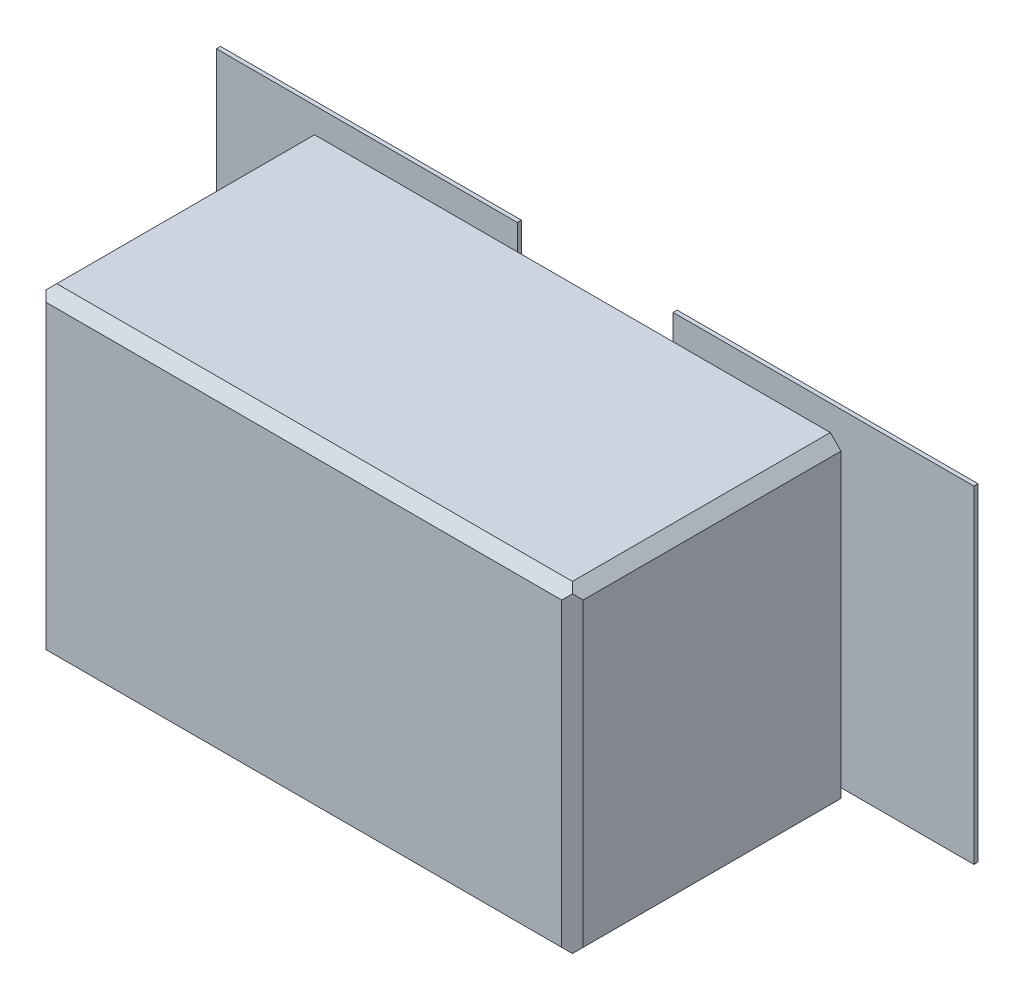
ISO-10303-21;
HEADER;
FILE_DESCRIPTION(('STEP AP214'),'2;1');
FILE_NAME('part.step','',(''),(''),'','','');
FILE_SCHEMA(('AUTOMOTIVE_DESIGN { 1 0 10303 214 1 1 1 1 }'));
ENDSEC;
DATA;
#1=APPLICATION_CONTEXT('core data for automotive mechanical design processes');
#2=APPLICATION_PROTOCOL_DEFINITION('international standard','automotive_design',2000,#1);
#3=PRODUCT_CONTEXT('',#1,'mechanical');
#4=PRODUCT('Part','Part','',(#3));
#5=PRODUCT_RELATED_PRODUCT_CATEGORY('part','',(#4));
#6=PRODUCT_DEFINITION_FORMATION('','',#4);
#7=PRODUCT_DEFINITION_CONTEXT('part definition',#1,'design');
#8=PRODUCT_DEFINITION('design','',#6,#7);
#9=PRODUCT_DEFINITION_SHAPE('','',#8);
#10=(LENGTH_UNIT() NAMED_UNIT(*) SI_UNIT(.MILLI.,.METRE.));
#11=(NAMED_UNIT(*) PLANE_ANGLE_UNIT() SI_UNIT($,.RADIAN.));
#12=(NAMED_UNIT(*) SI_UNIT($,.STERADIAN.) SOLID_ANGLE_UNIT());
#13=UNCERTAINTY_MEASURE_WITH_UNIT(LENGTH_MEASURE(1.E-05),#10,'distance_accuracy_value','');
#14=(GEOMETRIC_REPRESENTATION_CONTEXT(3) GLOBAL_UNCERTAINTY_ASSIGNED_CONTEXT((#13)) GLOBAL_UNIT_ASSIGNED_CONTEXT((#10,
#11,#12)) REPRESENTATION_CONTEXT('',''));
#15=CARTESIAN_POINT('',(0.,0.,0.));
#16=DIRECTION('',(0.,0.,1.));
#17=DIRECTION('',(1.,0.,0.));
#18=AXIS2_PLACEMENT_3D('',#15,#16,#17);
#19=CARTESIAN_POINT('',(0.,0.,0.0862));
#20=DIRECTION('',(0.,0.,-1.));
#21=DIRECTION('',(-1.,0.,0.));
#22=AXIS2_PLACEMENT_3D('',#19,#20,#21);
#23=PLANE('',#22);
#24=DIRECTION('',(1.,0.,0.));
#25=VECTOR('',#24,1.);
#26=CARTESIAN_POINT('',(-0.4159973957868,0.25,0.0862));
#27=LINE('',#26,#25);
#28=CARTESIAN_POINT('',(-0.2159973957868,0.25,0.0862));
#29=VERTEX_POINT('',#28);
#30=CARTESIAN_POINT('',(-0.4159973957868,0.25,0.0862));
#31=VERTEX_POINT('',#30);
#32=EDGE_CURVE('P0_E184',#29,#31,#27,.F.);
#33=ORIENTED_EDGE('',*,*,#32,.F.);
#34=DIRECTION('',(0.,1.,0.));
#35=VECTOR('',#34,1.);
#36=CARTESIAN_POINT('',(-0.2159973957868,0.25,0.0862));
#37=LINE('',#36,#35);
#38=CARTESIAN_POINT('',(-0.2159973957868,-0.25,0.0862));
#39=VERTEX_POINT('',#38);
#40=EDGE_CURVE('P0_E212',#39,#29,#37,.T.);
#41=ORIENTED_EDGE('',*,*,#40,.F.);
#42=DIRECTION('',(1.,0.,0.));
#43=VECTOR('',#42,1.);
#44=CARTESIAN_POINT('',(-0.2159973957868,-0.25,0.0862));
#45=LINE('',#44,#43);
#46=CARTESIAN_POINT('',(-0.4659973957868,-0.25,0.0862));
#47=VERTEX_POINT('',#46);
#48=EDGE_CURVE('P0_E163',#47,#39,#45,.T.);
#49=ORIENTED_EDGE('',*,*,#48,.F.);
#50=DIRECTION('',(0.,1.,0.));
#51=VECTOR('',#50,1.);
#52=CARTESIAN_POINT('',(-0.4659973957868,-0.25,0.0862));
#53=LINE('',#52,#51);
#54=CARTESIAN_POINT('',(-0.4659973957868,0.2,0.0862));
#55=VERTEX_POINT('',#54);
#56=EDGE_CURVE('P0_E157',#55,#47,#53,.F.);
#57=ORIENTED_EDGE('',*,*,#56,.F.);
#58=CARTESIAN_POINT('',(-0.4659973957868,0.25,0.0862));
#59=DIRECTION('',(0.,0.,-1.));
#60=DIRECTION('',(-1.,0.,0.));
#61=AXIS2_PLACEMENT_3D('',#58,#59,#60);
#62=CIRCLE('',#61,0.05);
#63=EDGE_CURVE('P0_E20',#55,#31,#62,.F.);
#64=ORIENTED_EDGE('',*,*,#63,.T.);
#65=EDGE_LOOP('',(#33,#41,#49,#57,#64));
#66=FACE_BOUND('',#65,.T.);
#67=ADVANCED_FACE('P0_F17',(#66),#23,.T.);
#68=CARTESIAN_POINT('',(0.,0.,0.0862));
#69=DIRECTION('',(0.,0.,-1.));
#70=DIRECTION('',(-1.,0.,0.));
#71=AXIS2_PLACEMENT_3D('',#68,#69,#70);
#72=PLANE('',#71);
#73=DIRECTION('',(1.,0.,0.));
#74=VECTOR('',#73,1.);
#75=CARTESIAN_POINT('',(0.1840026042132,0.25,0.0862));
#76=LINE('',#75,#74);
#77=CARTESIAN_POINT('',(0.4340026042132,0.25,0.0862));
#78=VERTEX_POINT('',#77);
#79=CARTESIAN_POINT('',(0.1840026042132,0.25,0.0862));
#80=VERTEX_POINT('',#79);
#81=EDGE_CURVE('P0_E232',#78,#80,#76,.F.);
#82=ORIENTED_EDGE('',*,*,#81,.F.);
#83=DIRECTION('',(0.,1.,0.));
#84=VECTOR('',#83,1.);
#85=CARTESIAN_POINT('',(0.4340026042132,0.25,0.0862));
#86=LINE('',#85,#84);
#87=CARTESIAN_POINT('',(0.4340026042132,-0.25,0.0862));
#88=VERTEX_POINT('',#87);
#89=EDGE_CURVE('P0_E249',#88,#78,#86,.T.);
#90=ORIENTED_EDGE('',*,*,#89,.F.);
#91=DIRECTION('',(1.,0.,0.));
#92=VECTOR('',#91,1.);
#93=CARTESIAN_POINT('',(0.4340026042132,-0.25,0.0862));
#94=LINE('',#93,#92);
#95=CARTESIAN_POINT('',(0.1840026042132,-0.25,0.0862));
#96=VERTEX_POINT('',#95);
#97=EDGE_CURVE('P0_E247',#96,#88,#94,.T.);
#98=ORIENTED_EDGE('',*,*,#97,.F.);
#99=DIRECTION('',(0.,1.,0.));
#100=VECTOR('',#99,1.);
#101=CARTESIAN_POINT('',(0.1840026042132,-0.25,0.0862));
#102=LINE('',#101,#100);
#103=EDGE_CURVE('P0_E241',#80,#96,#102,.F.);
#104=ORIENTED_EDGE('',*,*,#103,.F.);
#105=EDGE_LOOP('',(#82,#90,#98,#104));
#106=FACE_BOUND('',#105,.T.);
#107=ADVANCED_FACE('P0_F273',(#106),#72,.T.);
#108=CARTESIAN_POINT('',(-0.2159973957868,0.25,0.1262));
#109=DIRECTION('',(1.,0.,0.));
#110=DIRECTION('',(0.,0.,-1.));
#111=AXIS2_PLACEMENT_3D('',#108,#109,#110);
#112=PLANE('',#111);
#113=DIRECTION('',(0.,0.,1.));
#114=VECTOR('',#113,1.);
#115=CARTESIAN_POINT('',(-0.2159973957868,0.25,0.1262));
#116=LINE('',#115,#114);
#117=CARTESIAN_POINT('',(-0.2159973957868,0.25,0.1262));
#118=VERTEX_POINT('',#117);
#119=EDGE_CURVE('P0_E182',#118,#29,#116,.F.);
#120=ORIENTED_EDGE('',*,*,#119,.F.);
#121=DIRECTION('',(0.,1.,0.));
#122=VECTOR('',#121,1.);
#123=CARTESIAN_POINT('',(-0.2159973957868,0.,0.1262));
#124=LINE('',#123,#122);
#125=CARTESIAN_POINT('',(-0.2159973957868,-0.25,0.1262));
#126=VERTEX_POINT('',#125);
#127=EDGE_CURVE('P0_E194',#118,#126,#124,.F.);
#128=ORIENTED_EDGE('',*,*,#127,.T.);
#129=DIRECTION('',(0.,0.,-1.));
#130=VECTOR('',#129,1.);
#131=CARTESIAN_POINT('',(-0.2159973957868,-0.25,0.1262));
#132=LINE('',#131,#130);
#133=EDGE_CURVE('P0_E168',#39,#126,#132,.F.);
#134=ORIENTED_EDGE('',*,*,#133,.F.);
#135=ORIENTED_EDGE('',*,*,#40,.T.);
#136=EDGE_LOOP('',(#120,#128,#134,#135));
#137=FACE_BOUND('',#136,.T.);
#138=ADVANCED_FACE('P0_F262',(#137),#112,.T.);
#139=CARTESIAN_POINT('',(-0.2159973957868,-0.25,0.1262));
#140=DIRECTION('',(0.,-1.,0.));
#141=DIRECTION('',(0.,0.,-1.));
#142=AXIS2_PLACEMENT_3D('',#139,#140,#141);
#143=PLANE('',#142);
#144=ORIENTED_EDGE('',*,*,#133,.T.);
#145=DIRECTION('',(1.,0.,0.));
#146=VECTOR('',#145,1.);
#147=CARTESIAN_POINT('',(0.,-0.25,0.1262));
#148=LINE('',#147,#146);
#149=CARTESIAN_POINT('',(-0.4659973957868,-0.25,0.1262));
#150=VERTEX_POINT('',#149);
#151=EDGE_CURVE('P0_E196',#126,#150,#148,.F.);
#152=ORIENTED_EDGE('',*,*,#151,.T.);
#153=DIRECTION('',(0.,0.,1.));
#154=VECTOR('',#153,1.);
#155=CARTESIAN_POINT('',(-0.4659973957868,-0.25,0.1262));
#156=LINE('',#155,#154);
#157=EDGE_CURVE('P0_E167',#47,#150,#156,.T.);
#158=ORIENTED_EDGE('',*,*,#157,.F.);
#159=ORIENTED_EDGE('',*,*,#48,.T.);
#160=EDGE_LOOP('',(#144,#152,#158,#159));
#161=FACE_BOUND('',#160,.T.);
#162=ADVANCED_FACE('P0_F264',(#161),#143,.T.);
#163=CARTESIAN_POINT('',(-0.4659973957868,-0.25,0.1262));
#164=DIRECTION('',(-1.,0.,0.));
#165=DIRECTION('',(0.,0.,1.));
#166=AXIS2_PLACEMENT_3D('',#163,#164,#165);
#167=PLANE('',#166);
#168=ORIENTED_EDGE('',*,*,#157,.T.);
#169=DIRECTION('',(0.,1.,0.));
#170=VECTOR('',#169,1.);
#171=CARTESIAN_POINT('',(-0.4659973957868,0.,0.1262));
#172=LINE('',#171,#170);
#173=CARTESIAN_POINT('',(-0.4659973957868,0.2,0.1262));
#174=VERTEX_POINT('',#173);
#175=EDGE_CURVE('P0_E174',#150,#174,#172,.T.);
#176=ORIENTED_EDGE('',*,*,#175,.T.);
#177=DIRECTION('',(0.,0.,-1.));
#178=VECTOR('',#177,1.);
#179=CARTESIAN_POINT('',(-0.4659973957868,0.2,0.1262));
#180=LINE('',#179,#178);
#181=EDGE_CURVE('P0_E171',#174,#55,#180,.T.);
#182=ORIENTED_EDGE('',*,*,#181,.T.);
#183=ORIENTED_EDGE('',*,*,#56,.T.);
#184=EDGE_LOOP('',(#168,#176,#182,#183));
#185=FACE_BOUND('',#184,.T.);
#186=ADVANCED_FACE('P0_F172',(#185),#167,.T.);
#187=CARTESIAN_POINT('',(-0.4659973957868,0.25,0.1262));
#188=DIRECTION('',(0.,0.,-1.));
#189=DIRECTION('',(-1.,0.,0.));
#190=AXIS2_PLACEMENT_3D('',#187,#188,#189);
#191=CYLINDRICAL_SURFACE('',#190,0.05);
#192=ORIENTED_EDGE('',*,*,#63,.F.);
#193=ORIENTED_EDGE('',*,*,#181,.F.);
#194=CARTESIAN_POINT('',(-0.4659973957868,0.25,0.1262));
#195=DIRECTION('',(0.,0.,-1.));
#196=DIRECTION('',(-1.,0.,0.));
#197=AXIS2_PLACEMENT_3D('',#194,#195,#196);
#198=CIRCLE('',#197,0.05);
#199=CARTESIAN_POINT('',(-0.4159973957868,0.25,0.1262));
#200=VERTEX_POINT('',#199);
#201=EDGE_CURVE('P0_E220',#174,#200,#198,.F.);
#202=ORIENTED_EDGE('',*,*,#201,.T.);
#203=DIRECTION('',(0.,0.,1.));
#204=VECTOR('',#203,1.);
#205=CARTESIAN_POINT('',(-0.4159973957868,0.25,0.1262));
#206=LINE('',#205,#204);
#207=EDGE_CURVE('P0_E180',#31,#200,#206,.T.);
#208=ORIENTED_EDGE('',*,*,#207,.F.);
#209=EDGE_LOOP('',(#192,#193,#202,#208));
#210=FACE_BOUND('',#209,.T.);
#211=ADVANCED_FACE('P0_F178',(#210),#191,.F.);
#212=CARTESIAN_POINT('',(-0.4159973957868,0.25,0.1262));
#213=DIRECTION('',(0.,1.,0.));
#214=DIRECTION('',(0.,0.,1.));
#215=AXIS2_PLACEMENT_3D('',#212,#213,#214);
#216=PLANE('',#215);
#217=ORIENTED_EDGE('',*,*,#207,.T.);
#218=DIRECTION('',(1.,0.,0.));
#219=VECTOR('',#218,1.);
#220=CARTESIAN_POINT('',(0.,0.25,0.1262));
#221=LINE('',#220,#219);
#222=EDGE_CURVE('P0_E221',#200,#118,#221,.T.);
#223=ORIENTED_EDGE('',*,*,#222,.T.);
#224=ORIENTED_EDGE('',*,*,#119,.T.);
#225=ORIENTED_EDGE('',*,*,#32,.T.);
#226=EDGE_LOOP('',(#217,#223,#224,#225));
#227=FACE_BOUND('',#226,.T.);
#228=ADVANCED_FACE('P0_F254',(#227),#216,.T.);
#229=CARTESIAN_POINT('',(0.4340026042132,0.25,0.1262));
#230=DIRECTION('',(1.,0.,0.));
#231=DIRECTION('',(0.,0.,-1.));
#232=AXIS2_PLACEMENT_3D('',#229,#230,#231);
#233=PLANE('',#232);
#234=DIRECTION('',(0.,0.,1.));
#235=VECTOR('',#234,1.);
#236=CARTESIAN_POINT('',(0.4340026042132,0.25,0.1262));
#237=LINE('',#236,#235);
#238=CARTESIAN_POINT('',(0.4340026042132,0.25,0.1262));
#239=VERTEX_POINT('',#238);
#240=EDGE_CURVE('P0_E235',#239,#78,#237,.F.);
#241=ORIENTED_EDGE('',*,*,#240,.F.);
#242=DIRECTION('',(0.,1.,0.));
#243=VECTOR('',#242,1.);
#244=CARTESIAN_POINT('',(0.4340026042132,0.,0.1262));
#245=LINE('',#244,#243);
#246=CARTESIAN_POINT('',(0.4340026042132,-0.25,0.1262));
#247=VERTEX_POINT('',#246);
#248=EDGE_CURVE('P0_E222',#239,#247,#245,.F.);
#249=ORIENTED_EDGE('',*,*,#248,.T.);
#250=DIRECTION('',(0.,0.,-1.));
#251=VECTOR('',#250,1.);
#252=CARTESIAN_POINT('',(0.4340026042132,-0.25,0.1262));
#253=LINE('',#252,#251);
#254=EDGE_CURVE('P0_E244',#88,#247,#253,.F.);
#255=ORIENTED_EDGE('',*,*,#254,.F.);
#256=ORIENTED_EDGE('',*,*,#89,.T.);
#257=EDGE_LOOP('',(#241,#249,#255,#256));
#258=FACE_BOUND('',#257,.T.);
#259=ADVANCED_FACE('P0_F344',(#258),#233,.T.);
#260=CARTESIAN_POINT('',(0.4340026042132,-0.25,0.1262));
#261=DIRECTION('',(0.,-1.,0.));
#262=DIRECTION('',(0.,0.,-1.));
#263=AXIS2_PLACEMENT_3D('',#260,#261,#262);
#264=PLANE('',#263);
#265=ORIENTED_EDGE('',*,*,#254,.T.);
#266=DIRECTION('',(1.,0.,0.));
#267=VECTOR('',#266,1.);
#268=CARTESIAN_POINT('',(0.,-0.25,0.1262));
#269=LINE('',#268,#267);
#270=CARTESIAN_POINT('',(0.1840026042132,-0.25,0.1262));
#271=VERTEX_POINT('',#270);
#272=EDGE_CURVE('P0_E513',#247,#271,#269,.F.);
#273=ORIENTED_EDGE('',*,*,#272,.T.);
#274=DIRECTION('',(0.,0.,1.));
#275=VECTOR('',#274,1.);
#276=CARTESIAN_POINT('',(0.1840026042132,-0.25,0.1262));
#277=LINE('',#276,#275);
#278=EDGE_CURVE('P0_E238',#96,#271,#277,.T.);
#279=ORIENTED_EDGE('',*,*,#278,.F.);
#280=ORIENTED_EDGE('',*,*,#97,.T.);
#281=EDGE_LOOP('',(#265,#273,#279,#280));
#282=FACE_BOUND('',#281,.T.);
#283=ADVANCED_FACE('P0_F340',(#282),#264,.T.);
#284=CARTESIAN_POINT('',(0.1840026042132,-0.25,0.1262));
#285=DIRECTION('',(-1.,0.,0.));
#286=DIRECTION('',(0.,0.,1.));
#287=AXIS2_PLACEMENT_3D('',#284,#285,#286);
#288=PLANE('',#287);
#289=ORIENTED_EDGE('',*,*,#278,.T.);
#290=DIRECTION('',(0.,1.,0.));
#291=VECTOR('',#290,1.);
#292=CARTESIAN_POINT('',(0.1840026042132,0.,0.1262));
#293=LINE('',#292,#291);
#294=CARTESIAN_POINT('',(0.1840026042132,0.25,0.1262));
#295=VERTEX_POINT('',#294);
#296=EDGE_CURVE('P0_E517',#271,#295,#293,.T.);
#297=ORIENTED_EDGE('',*,*,#296,.T.);
#298=DIRECTION('',(0.,0.,1.));
#299=VECTOR('',#298,1.);
#300=CARTESIAN_POINT('',(0.1840026042132,0.25,0.1262));
#301=LINE('',#300,#299);
#302=EDGE_CURVE('P0_E197',#80,#295,#301,.T.);
#303=ORIENTED_EDGE('',*,*,#302,.F.);
#304=ORIENTED_EDGE('',*,*,#103,.T.);
#305=EDGE_LOOP('',(#289,#297,#303,#304));
#306=FACE_BOUND('',#305,.T.);
#307=ADVANCED_FACE('P0_F336',(#306),#288,.T.);
#308=CARTESIAN_POINT('',(0.1840026042132,0.25,0.1262));
#309=DIRECTION('',(0.,1.,0.));
#310=DIRECTION('',(0.,0.,1.));
#311=AXIS2_PLACEMENT_3D('',#308,#309,#310);
#312=PLANE('',#311);
#313=ORIENTED_EDGE('',*,*,#302,.T.);
#314=DIRECTION('',(1.,0.,0.));
#315=VECTOR('',#314,1.);
#316=CARTESIAN_POINT('',(0.,0.25,0.1262));
#317=LINE('',#316,#315);
#318=EDGE_CURVE('P0_E510',#295,#239,#317,.T.);
#319=ORIENTED_EDGE('',*,*,#318,.T.);
#320=ORIENTED_EDGE('',*,*,#240,.T.);
#321=ORIENTED_EDGE('',*,*,#81,.T.);
#322=EDGE_LOOP('',(#313,#319,#320,#321));
#323=FACE_BOUND('',#322,.T.);
#324=ADVANCED_FACE('P0_F332',(#323),#312,.T.);
#325=CARTESIAN_POINT('',(0.,0.,0.1262));
#326=DIRECTION('',(0.,0.,1.));
#327=DIRECTION('',(1.,0.,0.));
#328=AXIS2_PLACEMENT_3D('',#325,#326,#327);
#329=PLANE('',#328);
#330=ORIENTED_EDGE('',*,*,#296,.F.);
#331=ORIENTED_EDGE('',*,*,#272,.F.);
#332=ORIENTED_EDGE('',*,*,#248,.F.);
#333=ORIENTED_EDGE('',*,*,#318,.F.);
#334=EDGE_LOOP('',(#330,#331,#332,#333));
#335=FACE_BOUND('',#334,.T.);
#336=ORIENTED_EDGE('',*,*,#201,.F.);
#337=ORIENTED_EDGE('',*,*,#175,.F.);
#338=ORIENTED_EDGE('',*,*,#151,.F.);
#339=ORIENTED_EDGE('',*,*,#127,.F.);
#340=ORIENTED_EDGE('',*,*,#222,.F.);
#341=EDGE_LOOP('',(#336,#337,#338,#339,#340));
#342=FACE_BOUND('',#341,.T.);
#343=DIRECTION('',(0.707106781186548,0.707106781186548,0.));
#344=VECTOR('',#343,1.);
#345=CARTESIAN_POINT('',(0.49,-0.29,0.1262));
#346=LINE('',#345,#344);
#347=CARTESIAN_POINT('',(0.48,-0.3,0.1262));
#348=VERTEX_POINT('',#347);
#349=CARTESIAN_POINT('',(0.5,-0.28,0.1262));
#350=VERTEX_POINT('',#349);
#351=EDGE_CURVE('P0_E552',#348,#350,#346,.T.);
#352=ORIENTED_EDGE('',*,*,#351,.F.);
#353=DIRECTION('',(1.,0.,0.));
#354=VECTOR('',#353,1.);
#355=CARTESIAN_POINT('',(-0.5,-0.3,0.1262));
#356=LINE('',#355,#354);
#357=CARTESIAN_POINT('',(-0.48,-0.3,0.1262));
#358=VERTEX_POINT('',#357);
#359=EDGE_CURVE('P0_E542',#358,#348,#356,.T.);
#360=ORIENTED_EDGE('',*,*,#359,.F.);
#361=DIRECTION('',(0.707106781186548,-0.707106781186548,0.));
#362=VECTOR('',#361,1.);
#363=CARTESIAN_POINT('',(-0.49,-0.29,0.1262));
#364=LINE('',#363,#362);
#365=CARTESIAN_POINT('',(-0.5,-0.28,0.1262));
#366=VERTEX_POINT('',#365);
#367=EDGE_CURVE('P0_E537',#366,#358,#364,.T.);
#368=ORIENTED_EDGE('',*,*,#367,.F.);
#369=DIRECTION('',(0.,1.,0.));
#370=VECTOR('',#369,1.);
#371=CARTESIAN_POINT('',(-0.5,0.3,0.1262));
#372=LINE('',#371,#370);
#373=CARTESIAN_POINT('',(-0.5,0.28,0.1262));
#374=VERTEX_POINT('',#373);
#375=EDGE_CURVE('P0_E532',#374,#366,#372,.F.);
#376=ORIENTED_EDGE('',*,*,#375,.F.);
#377=DIRECTION('',(-0.707106781186548,-0.707106781186548,0.));
#378=VECTOR('',#377,1.);
#379=CARTESIAN_POINT('',(-0.49,0.29,0.1262));
#380=LINE('',#379,#378);
#381=CARTESIAN_POINT('',(-0.48,0.3,0.1262));
#382=VERTEX_POINT('',#381);
#383=EDGE_CURVE('P0_E527',#382,#374,#380,.T.);
#384=ORIENTED_EDGE('',*,*,#383,.F.);
#385=DIRECTION('',(1.,0.,0.));
#386=VECTOR('',#385,1.);
#387=CARTESIAN_POINT('',(0.5,0.3,0.1262));
#388=LINE('',#387,#386);
#389=CARTESIAN_POINT('',(0.48,0.3,0.1262));
#390=VERTEX_POINT('',#389);
#391=EDGE_CURVE('P0_E522',#390,#382,#388,.F.);
#392=ORIENTED_EDGE('',*,*,#391,.F.);
#393=DIRECTION('',(-0.707106781186548,0.707106781186548,0.));
#394=VECTOR('',#393,1.);
#395=CARTESIAN_POINT('',(0.49,0.29,0.1262));
#396=LINE('',#395,#394);
#397=CARTESIAN_POINT('',(0.5,0.28,0.1262));
#398=VERTEX_POINT('',#397);
#399=EDGE_CURVE('P0_E546',#398,#390,#396,.T.);
#400=ORIENTED_EDGE('',*,*,#399,.F.);
#401=DIRECTION('',(0.,1.,0.));
#402=VECTOR('',#401,1.);
#403=CARTESIAN_POINT('',(0.5,-0.3,0.1262));
#404=LINE('',#403,#402);
#405=EDGE_CURVE('P0_E557',#350,#398,#404,.T.);
#406=ORIENTED_EDGE('',*,*,#405,.F.);
#407=EDGE_LOOP('',(#352,#360,#368,#376,#384,#392,#400,#406));
#408=FACE_BOUND('',#407,.T.);
#409=ADVANCED_FACE('P0_F257',(#335,#342,#408),#329,.F.);
#410=CARTESIAN_POINT('',(0.5,0.3,0.0762));
#411=DIRECTION('',(0.,1.,0.));
#412=DIRECTION('',(0.,0.,1.));
#413=AXIS2_PLACEMENT_3D('',#410,#411,#412);
#414=PLANE('',#413);
#415=DIRECTION('',(1.,0.,0.));
#416=VECTOR('',#415,1.);
#417=CARTESIAN_POINT('',(0.,0.3,0.6062));
#418=LINE('',#417,#416);
#419=CARTESIAN_POINT('',(0.48,0.3,0.6062));
#420=VERTEX_POINT('',#419);
#421=CARTESIAN_POINT('',(-0.48,0.3,0.6062));
#422=VERTEX_POINT('',#421);
#423=EDGE_CURVE('P0_E566',#420,#422,#418,.F.);
#424=ORIENTED_EDGE('',*,*,#423,.F.);
#425=DIRECTION('',(0.,0.,1.));
#426=VECTOR('',#425,1.);
#427=CARTESIAN_POINT('',(0.48,0.3,0.3762));
#428=LINE('',#427,#426);
#429=EDGE_CURVE('P0_E544',#390,#420,#428,.T.);
#430=ORIENTED_EDGE('',*,*,#429,.F.);
#431=ORIENTED_EDGE('',*,*,#391,.T.);
#432=DIRECTION('',(0.,0.,1.));
#433=VECTOR('',#432,1.);
#434=CARTESIAN_POINT('',(-0.48,0.3,0.3762));
#435=LINE('',#434,#433);
#436=EDGE_CURVE('P0_E524',#422,#382,#435,.F.);
#437=ORIENTED_EDGE('',*,*,#436,.F.);
#438=EDGE_LOOP('',(#424,#430,#431,#437));
#439=FACE_BOUND('',#438,.T.);
#440=ADVANCED_FACE('P0_F325',(#439),#414,.T.);
#441=CARTESIAN_POINT('',(-0.49,0.29,0.3762));
#442=DIRECTION('',(-0.707106781186548,0.707106781186548,0.));
#443=DIRECTION('',(-0.707106781186548,-0.707106781186548,0.));
#444=AXIS2_PLACEMENT_3D('',#441,#442,#443);
#445=PLANE('',#444);
#446=ORIENTED_EDGE('',*,*,#436,.T.);
#447=ORIENTED_EDGE('',*,*,#383,.T.);
#448=DIRECTION('',(0.,0.,1.));
#449=VECTOR('',#448,1.);
#450=CARTESIAN_POINT('',(-0.5,0.28,0.0762));
#451=LINE('',#450,#449);
#452=CARTESIAN_POINT('',(-0.5,0.28,0.6062));
#453=VERTEX_POINT('',#452);
#454=EDGE_CURVE('P0_E529',#453,#374,#451,.F.);
#455=ORIENTED_EDGE('',*,*,#454,.F.);
#456=DIRECTION('',(-0.577350269189627,-0.577350269189624,-0.577350269189627));
#457=VECTOR('',#456,1.);
#458=CARTESIAN_POINT('',(-0.49,0.29,0.6162));
#459=LINE('',#458,#457);
#460=CARTESIAN_POINT('',(-0.49,0.29,0.6162));
#461=VERTEX_POINT('',#460);
#462=EDGE_CURVE('P0_E576',#461,#453,#459,.T.);
#463=ORIENTED_EDGE('',*,*,#462,.F.);
#464=DIRECTION('',(-0.577350269189624,-0.577350269189627,0.577350269189627));
#465=VECTOR('',#464,1.);
#466=CARTESIAN_POINT('',(-0.48,0.3,0.6062));
#467=LINE('',#466,#465);
#468=EDGE_CURVE('P0_E569',#422,#461,#467,.T.);
#469=ORIENTED_EDGE('',*,*,#468,.F.);
#470=EDGE_LOOP('',(#446,#447,#455,#463,#469));
#471=FACE_BOUND('',#470,.T.);
#472=ADVANCED_FACE('P0_F321',(#471),#445,.T.);
#473=CARTESIAN_POINT('',(-0.5,0.3,0.0762));
#474=DIRECTION('',(-1.,0.,0.));
#475=DIRECTION('',(0.,0.,1.));
#476=AXIS2_PLACEMENT_3D('',#473,#474,#475);
#477=PLANE('',#476);
#478=ORIENTED_EDGE('',*,*,#375,.T.);
#479=DIRECTION('',(0.,0.,1.));
#480=VECTOR('',#479,1.);
#481=CARTESIAN_POINT('',(-0.5,-0.28,0.3762));
#482=LINE('',#481,#480);
#483=CARTESIAN_POINT('',(-0.5,-0.28,0.6062));
#484=VERTEX_POINT('',#483);
#485=EDGE_CURVE('P0_E534',#484,#366,#482,.F.);
#486=ORIENTED_EDGE('',*,*,#485,.F.);
#487=DIRECTION('',(0.,1.,0.));
#488=VECTOR('',#487,1.);
#489=CARTESIAN_POINT('',(-0.5,0.,0.6062));
#490=LINE('',#489,#488);
#491=EDGE_CURVE('P0_E579',#453,#484,#490,.F.);
#492=ORIENTED_EDGE('',*,*,#491,.F.);
#493=ORIENTED_EDGE('',*,*,#454,.T.);
#494=EDGE_LOOP('',(#478,#486,#492,#493));
#495=FACE_BOUND('',#494,.T.);
#496=ADVANCED_FACE('P0_F317',(#495),#477,.T.);
#497=CARTESIAN_POINT('',(-0.49,-0.29,0.3762));
#498=DIRECTION('',(-0.707106781186548,-0.707106781186548,0.));
#499=DIRECTION('',(0.707106781186548,-0.707106781186548,0.));
#500=AXIS2_PLACEMENT_3D('',#497,#498,#499);
#501=PLANE('',#500);
#502=ORIENTED_EDGE('',*,*,#485,.T.);
#503=ORIENTED_EDGE('',*,*,#367,.T.);
#504=DIRECTION('',(0.,0.,-1.));
#505=VECTOR('',#504,1.);
#506=CARTESIAN_POINT('',(-0.48,-0.3,0.0762));
#507=LINE('',#506,#505);
#508=CARTESIAN_POINT('',(-0.48,-0.3,0.6062));
#509=VERTEX_POINT('',#508);
#510=EDGE_CURVE('P0_E539',#509,#358,#507,.T.);
#511=ORIENTED_EDGE('',*,*,#510,.F.);
#512=DIRECTION('',(0.577350269189624,-0.577350269189627,-0.577350269189627));
#513=VECTOR('',#512,1.);
#514=CARTESIAN_POINT('',(-0.49,-0.29,0.6162));
#515=LINE('',#514,#513);
#516=CARTESIAN_POINT('',(-0.49,-0.29,0.6162));
#517=VERTEX_POINT('',#516);
#518=EDGE_CURVE('P0_E587',#517,#509,#515,.T.);
#519=ORIENTED_EDGE('',*,*,#518,.F.);
#520=DIRECTION('',(0.577350269189627,-0.577350269189624,0.577350269189627));
#521=VECTOR('',#520,1.);
#522=CARTESIAN_POINT('',(-0.5,-0.28,0.6062));
#523=LINE('',#522,#521);
#524=EDGE_CURVE('P0_E571',#484,#517,#523,.T.);
#525=ORIENTED_EDGE('',*,*,#524,.F.);
#526=EDGE_LOOP('',(#502,#503,#511,#519,#525));
#527=FACE_BOUND('',#526,.T.);
#528=ADVANCED_FACE('P0_F313',(#527),#501,.T.);
#529=CARTESIAN_POINT('',(-0.5,-0.3,0.0762));
#530=DIRECTION('',(0.,-1.,0.));
#531=DIRECTION('',(0.,0.,-1.));
#532=AXIS2_PLACEMENT_3D('',#529,#530,#531);
#533=PLANE('',#532);
#534=ORIENTED_EDGE('',*,*,#359,.T.);
#535=DIRECTION('',(0.,0.,1.));
#536=VECTOR('',#535,1.);
#537=CARTESIAN_POINT('',(0.48,-0.3,0.3762));
#538=LINE('',#537,#536);
#539=CARTESIAN_POINT('',(0.48,-0.3,0.6062));
#540=VERTEX_POINT('',#539);
#541=EDGE_CURVE('P0_E549',#540,#348,#538,.F.);
#542=ORIENTED_EDGE('',*,*,#541,.F.);
#543=DIRECTION('',(1.,0.,0.));
#544=VECTOR('',#543,1.);
#545=CARTESIAN_POINT('',(0.,-0.3,0.6062));
#546=LINE('',#545,#544);
#547=EDGE_CURVE('P0_E590',#509,#540,#546,.T.);
#548=ORIENTED_EDGE('',*,*,#547,.F.);
#549=ORIENTED_EDGE('',*,*,#510,.T.);
#550=EDGE_LOOP('',(#534,#542,#548,#549));
#551=FACE_BOUND('',#550,.T.);
#552=ADVANCED_FACE('P0_F309',(#551),#533,.T.);
#553=CARTESIAN_POINT('',(0.49,0.29,0.3762));
#554=DIRECTION('',(0.707106781186548,0.707106781186548,0.));
#555=DIRECTION('',(-0.707106781186548,0.707106781186548,0.));
#556=AXIS2_PLACEMENT_3D('',#553,#554,#555);
#557=PLANE('',#556);
#558=DIRECTION('',(0.,0.,-1.));
#559=VECTOR('',#558,1.);
#560=CARTESIAN_POINT('',(0.5,0.28,0.0762));
#561=LINE('',#560,#559);
#562=CARTESIAN_POINT('',(0.5,0.28,0.6062));
#563=VERTEX_POINT('',#562);
#564=EDGE_CURVE('P0_E560',#398,#563,#561,.F.);
#565=ORIENTED_EDGE('',*,*,#564,.F.);
#566=ORIENTED_EDGE('',*,*,#399,.T.);
#567=ORIENTED_EDGE('',*,*,#429,.T.);
#568=DIRECTION('',(-0.577350269189624,0.577350269189627,-0.577350269189627));
#569=VECTOR('',#568,1.);
#570=CARTESIAN_POINT('',(0.49,0.29,0.6162));
#571=LINE('',#570,#569);
#572=CARTESIAN_POINT('',(0.49,0.29,0.6162));
#573=VERTEX_POINT('',#572);
#574=EDGE_CURVE('P0_E563',#573,#420,#571,.T.);
#575=ORIENTED_EDGE('',*,*,#574,.F.);
#576=DIRECTION('',(-0.577350269189627,0.577350269189624,0.577350269189627));
#577=VECTOR('',#576,1.);
#578=CARTESIAN_POINT('',(0.5,0.28,0.6062));
#579=LINE('',#578,#577);
#580=EDGE_CURVE('P0_E593',#563,#573,#579,.T.);
#581=ORIENTED_EDGE('',*,*,#580,.F.);
#582=EDGE_LOOP('',(#565,#566,#567,#575,#581));
#583=FACE_BOUND('',#582,.T.);
#584=ADVANCED_FACE('P0_F305',(#583),#557,.T.);
#585=CARTESIAN_POINT('',(0.49,-0.29,0.3762));
#586=DIRECTION('',(0.707106781186548,-0.707106781186548,0.));
#587=DIRECTION('',(0.707106781186548,0.707106781186548,0.));
#588=AXIS2_PLACEMENT_3D('',#585,#586,#587);
#589=PLANE('',#588);
#590=ORIENTED_EDGE('',*,*,#541,.T.);
#591=ORIENTED_EDGE('',*,*,#351,.T.);
#592=DIRECTION('',(0.,0.,-1.));
#593=VECTOR('',#592,1.);
#594=CARTESIAN_POINT('',(0.5,-0.28,0.0762));
#595=LINE('',#594,#593);
#596=CARTESIAN_POINT('',(0.5,-0.28,0.6062));
#597=VERTEX_POINT('',#596);
#598=EDGE_CURVE('P0_E554',#597,#350,#595,.T.);
#599=ORIENTED_EDGE('',*,*,#598,.F.);
#600=DIRECTION('',(0.577350269189627,0.577350269189624,-0.577350269189627));
#601=VECTOR('',#600,1.);
#602=CARTESIAN_POINT('',(0.49,-0.29,0.6162));
#603=LINE('',#602,#601);
#604=CARTESIAN_POINT('',(0.49,-0.29,0.6162));
#605=VERTEX_POINT('',#604);
#606=EDGE_CURVE('P0_E600',#605,#597,#603,.T.);
#607=ORIENTED_EDGE('',*,*,#606,.F.);
#608=DIRECTION('',(0.577350269189624,0.577350269189627,0.577350269189627));
#609=VECTOR('',#608,1.);
#610=CARTESIAN_POINT('',(0.48,-0.3,0.6062));
#611=LINE('',#610,#609);
#612=EDGE_CURVE('P0_E582',#540,#605,#611,.T.);
#613=ORIENTED_EDGE('',*,*,#612,.F.);
#614=EDGE_LOOP('',(#590,#591,#599,#607,#613));
#615=FACE_BOUND('',#614,.T.);
#616=ADVANCED_FACE('P0_F301',(#615),#589,.T.);
#617=CARTESIAN_POINT('',(0.5,-0.3,0.0762));
#618=DIRECTION('',(1.,0.,0.));
#619=DIRECTION('',(0.,0.,-1.));
#620=AXIS2_PLACEMENT_3D('',#617,#618,#619);
#621=PLANE('',#620);
#622=ORIENTED_EDGE('',*,*,#405,.T.);
#623=ORIENTED_EDGE('',*,*,#564,.T.);
#624=DIRECTION('',(0.,1.,0.));
#625=VECTOR('',#624,1.);
#626=CARTESIAN_POINT('',(0.5,0.,0.6062));
#627=LINE('',#626,#625);
#628=EDGE_CURVE('P0_E603',#597,#563,#627,.T.);
#629=ORIENTED_EDGE('',*,*,#628,.F.);
#630=ORIENTED_EDGE('',*,*,#598,.T.);
#631=EDGE_LOOP('',(#622,#623,#629,#630));
#632=FACE_BOUND('',#631,.T.);
#633=ADVANCED_FACE('P0_F297',(#632),#621,.T.);
#634=CARTESIAN_POINT('',(0.,0.29,0.6162));
#635=DIRECTION('',(0.,0.707106781186548,0.707106781186548));
#636=DIRECTION('',(0.,-0.707106781186548,0.707106781186548));
#637=AXIS2_PLACEMENT_3D('',#634,#635,#636);
#638=PLANE('',#637);
#639=DIRECTION('',(-0.577350269189627,0.577350269189624,-0.577350269189627));
#640=VECTOR('',#639,1.);
#641=CARTESIAN_POINT('',(-0.48,0.28,0.6262));
#642=LINE('',#641,#640);
#643=CARTESIAN_POINT('',(-0.48,0.28,0.6262));
#644=VERTEX_POINT('',#643);
#645=EDGE_CURVE('P0_E573',#644,#461,#642,.T.);
#646=ORIENTED_EDGE('',*,*,#645,.F.);
#647=DIRECTION('',(1.,0.,0.));
#648=VECTOR('',#647,1.);
#649=CARTESIAN_POINT('',(0.,0.28,0.6262));
#650=LINE('',#649,#648);
#651=CARTESIAN_POINT('',(0.48,0.28,0.6262));
#652=VERTEX_POINT('',#651);
#653=EDGE_CURVE('P0_E606',#652,#644,#650,.F.);
#654=ORIENTED_EDGE('',*,*,#653,.F.);
#655=DIRECTION('',(-0.577350269189627,-0.577350269189624,0.577350269189627));
#656=VECTOR('',#655,1.);
#657=CARTESIAN_POINT('',(0.49,0.29,0.6162));
#658=LINE('',#657,#656);
#659=EDGE_CURVE('P0_E596',#573,#652,#658,.T.);
#660=ORIENTED_EDGE('',*,*,#659,.F.);
#661=ORIENTED_EDGE('',*,*,#574,.T.);
#662=ORIENTED_EDGE('',*,*,#423,.T.);
#663=ORIENTED_EDGE('',*,*,#468,.T.);
#664=EDGE_LOOP('',(#646,#654,#660,#661,#662,#663));
#665=FACE_BOUND('',#664,.T.);
#666=ADVANCED_FACE('P0_F293',(#665),#638,.T.);
#667=CARTESIAN_POINT('',(-0.49,0.,0.6162));
#668=DIRECTION('',(-0.707106781186548,0.,0.707106781186548));
#669=DIRECTION('',(0.707106781186548,0.,0.707106781186548));
#670=AXIS2_PLACEMENT_3D('',#667,#668,#669);
#671=PLANE('',#670);
#672=ORIENTED_EDGE('',*,*,#462,.T.);
#673=ORIENTED_EDGE('',*,*,#491,.T.);
#674=ORIENTED_EDGE('',*,*,#524,.T.);
#675=DIRECTION('',(-0.577350269189624,-0.577350269189627,-0.577350269189627));
#676=VECTOR('',#675,1.);
#677=CARTESIAN_POINT('',(-0.48,-0.28,0.6262));
#678=LINE('',#677,#676);
#679=CARTESIAN_POINT('',(-0.48,-0.28,0.6262));
#680=VERTEX_POINT('',#679);
#681=EDGE_CURVE('P0_E584',#680,#517,#678,.T.);
#682=ORIENTED_EDGE('',*,*,#681,.F.);
#683=DIRECTION('',(0.,1.,0.));
#684=VECTOR('',#683,1.);
#685=CARTESIAN_POINT('',(-0.48,0.,0.6262));
#686=LINE('',#685,#684);
#687=EDGE_CURVE('P0_E609',#644,#680,#686,.F.);
#688=ORIENTED_EDGE('',*,*,#687,.F.);
#689=ORIENTED_EDGE('',*,*,#645,.T.);
#690=EDGE_LOOP('',(#672,#673,#674,#682,#688,#689));
#691=FACE_BOUND('',#690,.T.);
#692=ADVANCED_FACE('P0_F290',(#691),#671,.T.);
#693=CARTESIAN_POINT('',(0.,-0.29,0.6162));
#694=DIRECTION('',(0.,-0.707106781186548,0.707106781186548));
#695=DIRECTION('',(0.,-0.707106781186548,-0.707106781186548));
#696=AXIS2_PLACEMENT_3D('',#693,#694,#695);
#697=PLANE('',#696);
#698=ORIENTED_EDGE('',*,*,#518,.T.);
#699=ORIENTED_EDGE('',*,*,#547,.T.);
#700=ORIENTED_EDGE('',*,*,#612,.T.);
#701=DIRECTION('',(0.577350269189627,-0.577350269189624,-0.577350269189627));
#702=VECTOR('',#701,1.);
#703=CARTESIAN_POINT('',(0.48,-0.28,0.6262));
#704=LINE('',#703,#702);
#705=CARTESIAN_POINT('',(0.48,-0.28,0.6262));
#706=VERTEX_POINT('',#705);
#707=EDGE_CURVE('P0_E35',#706,#605,#704,.T.);
#708=ORIENTED_EDGE('',*,*,#707,.F.);
#709=DIRECTION('',(1.,0.,0.));
#710=VECTOR('',#709,1.);
#711=CARTESIAN_POINT('',(0.,-0.28,0.6262));
#712=LINE('',#711,#710);
#713=EDGE_CURVE('P0_E26',#680,#706,#712,.T.);
#714=ORIENTED_EDGE('',*,*,#713,.F.);
#715=ORIENTED_EDGE('',*,*,#681,.T.);
#716=EDGE_LOOP('',(#698,#699,#700,#708,#714,#715));
#717=FACE_BOUND('',#716,.T.);
#718=ADVANCED_FACE('P0_F283',(#717),#697,.T.);
#719=CARTESIAN_POINT('',(0.49,0.,0.6162));
#720=DIRECTION('',(0.707106781186548,0.,0.707106781186548));
#721=DIRECTION('',(0.707106781186548,0.,-0.707106781186548));
#722=AXIS2_PLACEMENT_3D('',#719,#720,#721);
#723=PLANE('',#722);
#724=ORIENTED_EDGE('',*,*,#606,.T.);
#725=ORIENTED_EDGE('',*,*,#628,.T.);
#726=ORIENTED_EDGE('',*,*,#580,.T.);
#727=ORIENTED_EDGE('',*,*,#659,.T.);
#728=DIRECTION('',(0.,1.,0.));
#729=VECTOR('',#728,1.);
#730=CARTESIAN_POINT('',(0.48,0.,0.6262));
#731=LINE('',#730,#729);
#732=EDGE_CURVE('P0_E11',#706,#652,#731,.T.);
#733=ORIENTED_EDGE('',*,*,#732,.F.);
#734=ORIENTED_EDGE('',*,*,#707,.T.);
#735=EDGE_LOOP('',(#724,#725,#726,#727,#733,#734));
#736=FACE_BOUND('',#735,.T.);
#737=ADVANCED_FACE('P0_F277',(#736),#723,.T.);
#738=CARTESIAN_POINT('',(0.,0.,0.6262));
#739=DIRECTION('',(0.,0.,1.));
#740=DIRECTION('',(1.,0.,0.));
#741=AXIS2_PLACEMENT_3D('',#738,#739,#740);
#742=PLANE('',#741);
#743=ORIENTED_EDGE('',*,*,#713,.T.);
#744=ORIENTED_EDGE('',*,*,#732,.T.);
#745=ORIENTED_EDGE('',*,*,#653,.T.);
#746=ORIENTED_EDGE('',*,*,#687,.T.);
#747=EDGE_LOOP('',(#743,#744,#745,#746));
#748=FACE_BOUND('',#747,.T.);
#749=ADVANCED_FACE('P0_F275',(#748),#742,.T.);
#750=CLOSED_SHELL('',(#67,#107,#138,#162,#186,#211,#228,#259,#283,#307,#324,#409,#440,#472,#496,
#528,#552,#584,#616,#633,#666,#692,#718,#737,#749));
#751=MANIFOLD_SOLID_BREP('P0_B1',#750);
#752=CARTESIAN_POINT('',(0.,0.,0.08382));
#753=DIRECTION('',(0.,0.,1.));
#754=DIRECTION('',(1.,0.,0.));
#755=AXIS2_PLACEMENT_3D('',#752,#753,#754);
#756=PLANE('',#755);
#757=DIRECTION('',(0.,1.,0.));
#758=VECTOR('',#757,1.);
#759=CARTESIAN_POINT('',(0.145,0.305,0.08382));
#760=LINE('',#759,#758);
#761=CARTESIAN_POINT('',(0.145,-0.305,0.08382));
#762=VERTEX_POINT('',#761);
#763=CARTESIAN_POINT('',(0.145,0.305,0.08382));
#764=VERTEX_POINT('',#763);
#765=EDGE_CURVE('P1_E68',#762,#764,#760,.T.);
#766=ORIENTED_EDGE('',*,*,#765,.F.);
#767=DIRECTION('',(1.,0.,0.));
#768=VECTOR('',#767,1.);
#769=CARTESIAN_POINT('',(0.145,-0.305,0.08382));
#770=LINE('',#769,#768);
#771=CARTESIAN_POINT('',(0.705,-0.305,0.08382));
#772=VERTEX_POINT('',#771);
#773=EDGE_CURVE('P1_E20',#772,#762,#770,.F.);
#774=ORIENTED_EDGE('',*,*,#773,.F.);
#775=DIRECTION('',(0.,1.,0.));
#776=VECTOR('',#775,1.);
#777=CARTESIAN_POINT('',(0.705,-0.305,0.08382));
#778=LINE('',#777,#776);
#779=CARTESIAN_POINT('',(0.705,0.305,0.08382));
#780=VERTEX_POINT('',#779);
#781=EDGE_CURVE('P1_E58',#780,#772,#778,.F.);
#782=ORIENTED_EDGE('',*,*,#781,.F.);
#783=DIRECTION('',(1.,0.,0.));
#784=VECTOR('',#783,1.);
#785=CARTESIAN_POINT('',(0.705,0.305,0.08382));
#786=LINE('',#785,#784);
#787=EDGE_CURVE('P1_E53',#764,#780,#786,.T.);
#788=ORIENTED_EDGE('',*,*,#787,.F.);
#789=EDGE_LOOP('',(#766,#774,#782,#788));
#790=FACE_BOUND('',#789,.T.);
#791=ADVANCED_FACE('P1_F17',(#790),#756,.T.);
#792=CARTESIAN_POINT('',(0.145,-0.305,0.0762));
#793=DIRECTION('',(0.,-1.,0.));
#794=DIRECTION('',(0.,0.,-1.));
#795=AXIS2_PLACEMENT_3D('',#792,#793,#794);
#796=PLANE('',#795);
#797=DIRECTION('',(0.,0.,1.));
#798=VECTOR('',#797,1.);
#799=CARTESIAN_POINT('',(0.145,-0.305,0.0762));
#800=LINE('',#799,#798);
#801=CARTESIAN_POINT('',(0.145,-0.305,0.0762));
#802=VERTEX_POINT('',#801);
#803=EDGE_CURVE('P1_E79',#802,#762,#800,.T.);
#804=ORIENTED_EDGE('',*,*,#803,.F.);
#805=DIRECTION('',(1.,0.,0.));
#806=VECTOR('',#805,1.);
#807=CARTESIAN_POINT('',(0.,-0.305,0.0762));
#808=LINE('',#807,#806);
#809=CARTESIAN_POINT('',(0.705,-0.305,0.0762));
#810=VERTEX_POINT('',#809);
#811=EDGE_CURVE('P1_E74',#802,#810,#808,.T.);
#812=ORIENTED_EDGE('',*,*,#811,.T.);
#813=DIRECTION('',(0.,0.,-1.));
#814=VECTOR('',#813,1.);
#815=CARTESIAN_POINT('',(0.705,-0.305,0.0762));
#816=LINE('',#815,#814);
#817=EDGE_CURVE('P1_E63',#772,#810,#816,.T.);
#818=ORIENTED_EDGE('',*,*,#817,.F.);
#819=ORIENTED_EDGE('',*,*,#773,.T.);
#820=EDGE_LOOP('',(#804,#812,#818,#819));
#821=FACE_BOUND('',#820,.T.);
#822=ADVANCED_FACE('P1_F73',(#821),#796,.T.);
#823=CARTESIAN_POINT('',(0.705,-0.305,0.0762));
#824=DIRECTION('',(1.,0.,0.));
#825=DIRECTION('',(0.,0.,-1.));
#826=AXIS2_PLACEMENT_3D('',#823,#824,#825);
#827=PLANE('',#826);
#828=ORIENTED_EDGE('',*,*,#817,.T.);
#829=DIRECTION('',(0.,1.,0.));
#830=VECTOR('',#829,1.);
#831=CARTESIAN_POINT('',(0.705,0.,0.0762));
#832=LINE('',#831,#830);
#833=CARTESIAN_POINT('',(0.705,0.305,0.0762));
#834=VERTEX_POINT('',#833);
#835=EDGE_CURVE('P1_E84',#810,#834,#832,.T.);
#836=ORIENTED_EDGE('',*,*,#835,.T.);
#837=DIRECTION('',(0.,0.,1.));
#838=VECTOR('',#837,1.);
#839=CARTESIAN_POINT('',(0.705,0.305,0.0762));
#840=LINE('',#839,#838);
#841=EDGE_CURVE('P1_E65',#780,#834,#840,.F.);
#842=ORIENTED_EDGE('',*,*,#841,.F.);
#843=ORIENTED_EDGE('',*,*,#781,.T.);
#844=EDGE_LOOP('',(#828,#836,#842,#843));
#845=FACE_BOUND('',#844,.T.);
#846=ADVANCED_FACE('P1_F60',(#845),#827,.T.);
#847=CARTESIAN_POINT('',(0.705,0.305,0.0762));
#848=DIRECTION('',(0.,1.,0.));
#849=DIRECTION('',(0.,0.,1.));
#850=AXIS2_PLACEMENT_3D('',#847,#848,#849);
#851=PLANE('',#850);
#852=ORIENTED_EDGE('',*,*,#841,.T.);
#853=DIRECTION('',(1.,0.,0.));
#854=VECTOR('',#853,1.);
#855=CARTESIAN_POINT('',(0.,0.305,0.0762));
#856=LINE('',#855,#854);
#857=CARTESIAN_POINT('',(0.145,0.305,0.0762));
#858=VERTEX_POINT('',#857);
#859=EDGE_CURVE('P1_E26',#834,#858,#856,.F.);
#860=ORIENTED_EDGE('',*,*,#859,.T.);
#861=DIRECTION('',(0.,0.,1.));
#862=VECTOR('',#861,1.);
#863=CARTESIAN_POINT('',(0.145,0.305,0.0762));
#864=LINE('',#863,#862);
#865=EDGE_CURVE('P1_E34',#764,#858,#864,.F.);
#866=ORIENTED_EDGE('',*,*,#865,.F.);
#867=ORIENTED_EDGE('',*,*,#787,.T.);
#868=EDGE_LOOP('',(#852,#860,#866,#867));
#869=FACE_BOUND('',#868,.T.);
#870=ADVANCED_FACE('P1_F88',(#869),#851,.T.);
#871=CARTESIAN_POINT('',(0.145,0.305,0.0762));
#872=DIRECTION('',(-1.,0.,0.));
#873=DIRECTION('',(0.,0.,1.));
#874=AXIS2_PLACEMENT_3D('',#871,#872,#873);
#875=PLANE('',#874);
#876=ORIENTED_EDGE('',*,*,#865,.T.);
#877=DIRECTION('',(0.,1.,0.));
#878=VECTOR('',#877,1.);
#879=CARTESIAN_POINT('',(0.145,0.,0.0762));
#880=LINE('',#879,#878);
#881=EDGE_CURVE('P1_E11',#858,#802,#880,.F.);
#882=ORIENTED_EDGE('',*,*,#881,.T.);
#883=ORIENTED_EDGE('',*,*,#803,.T.);
#884=ORIENTED_EDGE('',*,*,#765,.T.);
#885=EDGE_LOOP('',(#876,#882,#883,#884));
#886=FACE_BOUND('',#885,.T.);
#887=ADVANCED_FACE('P1_F91',(#886),#875,.T.);
#888=CARTESIAN_POINT('',(0.,0.,0.0762));
#889=DIRECTION('',(0.,0.,1.));
#890=DIRECTION('',(1.,0.,0.));
#891=AXIS2_PLACEMENT_3D('',#888,#889,#890);
#892=PLANE('',#891);
#893=ORIENTED_EDGE('',*,*,#859,.F.);
#894=ORIENTED_EDGE('',*,*,#835,.F.);
#895=ORIENTED_EDGE('',*,*,#811,.F.);
#896=ORIENTED_EDGE('',*,*,#881,.F.);
#897=EDGE_LOOP('',(#893,#894,#895,#896));
#898=FACE_BOUND('',#897,.T.);
#899=ADVANCED_FACE('P1_F90',(#898),#892,.F.);
#900=CLOSED_SHELL('',(#791,#822,#846,#870,#887,#899));
#901=MANIFOLD_SOLID_BREP('P1_B1',#900);
#902=CARTESIAN_POINT('',(0.,0.,0.08382));
#903=DIRECTION('',(0.,0.,1.));
#904=DIRECTION('',(1.,0.,0.));
#905=AXIS2_PLACEMENT_3D('',#902,#903,#904);
#906=PLANE('',#905);
#907=DIRECTION('',(0.,1.,0.));
#908=VECTOR('',#907,1.);
#909=CARTESIAN_POINT('',(-0.705,0.305,0.08382));
#910=LINE('',#909,#908);
#911=CARTESIAN_POINT('',(-0.705,-0.305,0.08382));
#912=VERTEX_POINT('',#911);
#913=CARTESIAN_POINT('',(-0.705,0.305,0.08382));
#914=VERTEX_POINT('',#913);
#915=EDGE_CURVE('P2_E68',#912,#914,#910,.T.);
#916=ORIENTED_EDGE('',*,*,#915,.F.);
#917=DIRECTION('',(1.,0.,0.));
#918=VECTOR('',#917,1.);
#919=CARTESIAN_POINT('',(-0.705,-0.305,0.08382));
#920=LINE('',#919,#918);
#921=CARTESIAN_POINT('',(-0.145,-0.305,0.08382));
#922=VERTEX_POINT('',#921);
#923=EDGE_CURVE('P2_E20',#922,#912,#920,.F.);
#924=ORIENTED_EDGE('',*,*,#923,.F.);
#925=DIRECTION('',(0.,1.,0.));
#926=VECTOR('',#925,1.);
#927=CARTESIAN_POINT('',(-0.145,-0.305,0.08382));
#928=LINE('',#927,#926);
#929=CARTESIAN_POINT('',(-0.145,0.305,0.08382));
#930=VERTEX_POINT('',#929);
#931=EDGE_CURVE('P2_E58',#930,#922,#928,.F.);
#932=ORIENTED_EDGE('',*,*,#931,.F.);
#933=DIRECTION('',(1.,0.,0.));
#934=VECTOR('',#933,1.);
#935=CARTESIAN_POINT('',(-0.145,0.305,0.08382));
#936=LINE('',#935,#934);
#937=EDGE_CURVE('P2_E53',#914,#930,#936,.T.);
#938=ORIENTED_EDGE('',*,*,#937,.F.);
#939=EDGE_LOOP('',(#916,#924,#932,#938));
#940=FACE_BOUND('',#939,.T.);
#941=ADVANCED_FACE('P2_F17',(#940),#906,.T.);
#942=CARTESIAN_POINT('',(-0.705,-0.305,0.0762));
#943=DIRECTION('',(0.,-1.,0.));
#944=DIRECTION('',(0.,0.,-1.));
#945=AXIS2_PLACEMENT_3D('',#942,#943,#944);
#946=PLANE('',#945);
#947=DIRECTION('',(0.,0.,1.));
#948=VECTOR('',#947,1.);
#949=CARTESIAN_POINT('',(-0.705,-0.305,0.0762));
#950=LINE('',#949,#948);
#951=CARTESIAN_POINT('',(-0.705,-0.305,0.0762));
#952=VERTEX_POINT('',#951);
#953=EDGE_CURVE('P2_E79',#952,#912,#950,.T.);
#954=ORIENTED_EDGE('',*,*,#953,.F.);
#955=DIRECTION('',(1.,0.,0.));
#956=VECTOR('',#955,1.);
#957=CARTESIAN_POINT('',(0.,-0.305,0.0762));
#958=LINE('',#957,#956);
#959=CARTESIAN_POINT('',(-0.145,-0.305,0.0762));
#960=VERTEX_POINT('',#959);
#961=EDGE_CURVE('P2_E74',#952,#960,#958,.T.);
#962=ORIENTED_EDGE('',*,*,#961,.T.);
#963=DIRECTION('',(0.,0.,-1.));
#964=VECTOR('',#963,1.);
#965=CARTESIAN_POINT('',(-0.145,-0.305,0.0762));
#966=LINE('',#965,#964);
#967=EDGE_CURVE('P2_E63',#922,#960,#966,.T.);
#968=ORIENTED_EDGE('',*,*,#967,.F.);
#969=ORIENTED_EDGE('',*,*,#923,.T.);
#970=EDGE_LOOP('',(#954,#962,#968,#969));
#971=FACE_BOUND('',#970,.T.);
#972=ADVANCED_FACE('P2_F73',(#971),#946,.T.);
#973=CARTESIAN_POINT('',(-0.145,-0.305,0.0762));
#974=DIRECTION('',(1.,0.,0.));
#975=DIRECTION('',(0.,0.,-1.));
#976=AXIS2_PLACEMENT_3D('',#973,#974,#975);
#977=PLANE('',#976);
#978=ORIENTED_EDGE('',*,*,#967,.T.);
#979=DIRECTION('',(0.,1.,0.));
#980=VECTOR('',#979,1.);
#981=CARTESIAN_POINT('',(-0.145,0.,0.0762));
#982=LINE('',#981,#980);
#983=CARTESIAN_POINT('',(-0.145,0.305,0.0762));
#984=VERTEX_POINT('',#983);
#985=EDGE_CURVE('P2_E84',#960,#984,#982,.T.);
#986=ORIENTED_EDGE('',*,*,#985,.T.);
#987=DIRECTION('',(0.,0.,1.));
#988=VECTOR('',#987,1.);
#989=CARTESIAN_POINT('',(-0.145,0.305,0.0762));
#990=LINE('',#989,#988);
#991=EDGE_CURVE('P2_E65',#930,#984,#990,.F.);
#992=ORIENTED_EDGE('',*,*,#991,.F.);
#993=ORIENTED_EDGE('',*,*,#931,.T.);
#994=EDGE_LOOP('',(#978,#986,#992,#993));
#995=FACE_BOUND('',#994,.T.);
#996=ADVANCED_FACE('P2_F60',(#995),#977,.T.);
#997=CARTESIAN_POINT('',(-0.145,0.305,0.0762));
#998=DIRECTION('',(0.,1.,0.));
#999=DIRECTION('',(0.,0.,1.));
#1000=AXIS2_PLACEMENT_3D('',#997,#998,#999);
#1001=PLANE('',#1000);
#1002=ORIENTED_EDGE('',*,*,#991,.T.);
#1003=DIRECTION('',(1.,0.,0.));
#1004=VECTOR('',#1003,1.);
#1005=CARTESIAN_POINT('',(0.,0.305,0.0762));
#1006=LINE('',#1005,#1004);
#1007=CARTESIAN_POINT('',(-0.705,0.305,0.0762));
#1008=VERTEX_POINT('',#1007);
#1009=EDGE_CURVE('P2_E26',#984,#1008,#1006,.F.);
#1010=ORIENTED_EDGE('',*,*,#1009,.T.);
#1011=DIRECTION('',(0.,0.,1.));
#1012=VECTOR('',#1011,1.);
#1013=CARTESIAN_POINT('',(-0.705,0.305,0.0762));
#1014=LINE('',#1013,#1012);
#1015=EDGE_CURVE('P2_E34',#914,#1008,#1014,.F.);
#1016=ORIENTED_EDGE('',*,*,#1015,.F.);
#1017=ORIENTED_EDGE('',*,*,#937,.T.);
#1018=EDGE_LOOP('',(#1002,#1010,#1016,#1017));
#1019=FACE_BOUND('',#1018,.T.);
#1020=ADVANCED_FACE('P2_F88',(#1019),#1001,.T.);
#1021=CARTESIAN_POINT('',(-0.705,0.305,0.0762));
#1022=DIRECTION('',(-1.,0.,0.));
#1023=DIRECTION('',(0.,0.,1.));
#1024=AXIS2_PLACEMENT_3D('',#1021,#1022,#1023);
#1025=PLANE('',#1024);
#1026=ORIENTED_EDGE('',*,*,#1015,.T.);
#1027=DIRECTION('',(0.,1.,0.));
#1028=VECTOR('',#1027,1.);
#1029=CARTESIAN_POINT('',(-0.705,0.,0.0762));
#1030=LINE('',#1029,#1028);
#1031=EDGE_CURVE('P2_E11',#1008,#952,#1030,.F.);
#1032=ORIENTED_EDGE('',*,*,#1031,.T.);
#1033=ORIENTED_EDGE('',*,*,#953,.T.);
#1034=ORIENTED_EDGE('',*,*,#915,.T.);
#1035=EDGE_LOOP('',(#1026,#1032,#1033,#1034));
#1036=FACE_BOUND('',#1035,.T.);
#1037=ADVANCED_FACE('P2_F91',(#1036),#1025,.T.);
#1038=CARTESIAN_POINT('',(0.,0.,0.0762));
#1039=DIRECTION('',(0.,0.,1.));
#1040=DIRECTION('',(1.,0.,0.));
#1041=AXIS2_PLACEMENT_3D('',#1038,#1039,#1040);
#1042=PLANE('',#1041);
#1043=ORIENTED_EDGE('',*,*,#1009,.F.);
#1044=ORIENTED_EDGE('',*,*,#985,.F.);
#1045=ORIENTED_EDGE('',*,*,#961,.F.);
#1046=ORIENTED_EDGE('',*,*,#1031,.F.);
#1047=EDGE_LOOP('',(#1043,#1044,#1045,#1046));
#1048=FACE_BOUND('',#1047,.T.);
#1049=ADVANCED_FACE('P2_F90',(#1048),#1042,.F.);
#1050=CLOSED_SHELL('',(#941,#972,#996,#1020,#1037,#1049));
#1051=MANIFOLD_SOLID_BREP('P2_B1',#1050);
#1052=ADVANCED_BREP_SHAPE_REPRESENTATION('',(#18,#751,#901,#1051),#14);
#1053=SHAPE_DEFINITION_REPRESENTATION(#9,#1052);
ENDSEC;
END-ISO-10303-21;
